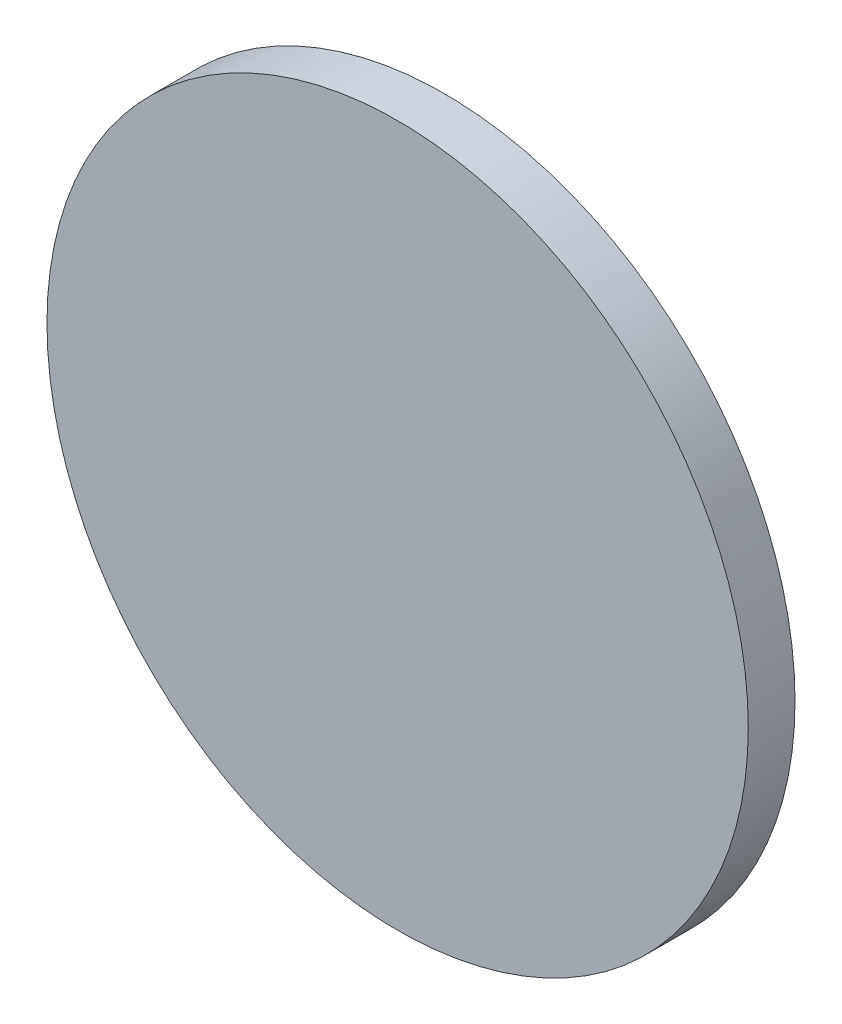
ISO-10303-21;
HEADER;
FILE_DESCRIPTION(('STEP AP214'),'2;1');
FILE_NAME('part.step','',(''),(''),'','','');
FILE_SCHEMA(('AUTOMOTIVE_DESIGN { 1 0 10303 214 1 1 1 1 }'));
ENDSEC;
DATA;
#1=APPLICATION_CONTEXT('core data for automotive mechanical design processes');
#2=APPLICATION_PROTOCOL_DEFINITION('international standard','automotive_design',2000,#1);
#3=PRODUCT_CONTEXT('',#1,'mechanical');
#4=PRODUCT('Part','Part','',(#3));
#5=PRODUCT_RELATED_PRODUCT_CATEGORY('part','',(#4));
#6=PRODUCT_DEFINITION_FORMATION('','',#4);
#7=PRODUCT_DEFINITION_CONTEXT('part definition',#1,'design');
#8=PRODUCT_DEFINITION('design','',#6,#7);
#9=PRODUCT_DEFINITION_SHAPE('','',#8);
#10=(LENGTH_UNIT() NAMED_UNIT(*) SI_UNIT(.MILLI.,.METRE.));
#11=(NAMED_UNIT(*) PLANE_ANGLE_UNIT() SI_UNIT($,.RADIAN.));
#12=(NAMED_UNIT(*) SI_UNIT($,.STERADIAN.) SOLID_ANGLE_UNIT());
#13=UNCERTAINTY_MEASURE_WITH_UNIT(LENGTH_MEASURE(1.E-05),#10,'distance_accuracy_value','');
#14=(GEOMETRIC_REPRESENTATION_CONTEXT(3) GLOBAL_UNCERTAINTY_ASSIGNED_CONTEXT((#13)) GLOBAL_UNIT_ASSIGNED_CONTEXT((#10,
#11,#12)) REPRESENTATION_CONTEXT('',''));
#15=CARTESIAN_POINT('',(0.,0.,0.));
#16=DIRECTION('',(0.,0.,1.));
#17=DIRECTION('',(1.,0.,0.));
#18=AXIS2_PLACEMENT_3D('',#15,#16,#17);
#19=CARTESIAN_POINT('',(475.,-275.,2.));
#20=DIRECTION('',(0.,0.,-1.));
#21=DIRECTION('',(-1.,0.,0.));
#22=AXIS2_PLACEMENT_3D('',#19,#20,#21);
#23=CYLINDRICAL_SURFACE('',#22,15.);
#24=CARTESIAN_POINT('',(475.,-275.,2.));
#25=DIRECTION('',(0.,0.,1.));
#26=DIRECTION('',(1.,0.,0.));
#27=AXIS2_PLACEMENT_3D('',#24,#25,#26);
#28=CIRCLE('',#27,15.);
#29=CARTESIAN_POINT('',(490.,-275.,2.));
#30=VERTEX_POINT('',#29);
#31=EDGE_CURVE('E10',#30,#30,#28,.T.);
#32=ORIENTED_EDGE('',*,*,#31,.F.);
#33=EDGE_LOOP('',(#32));
#34=FACE_BOUND('',#33,.T.);
#35=CARTESIAN_POINT('',(475.,-275.,0.));
#36=DIRECTION('',(0.,0.,1.));
#37=DIRECTION('',(1.,0.,0.));
#38=AXIS2_PLACEMENT_3D('',#35,#36,#37);
#39=CIRCLE('',#38,15.);
#40=CARTESIAN_POINT('',(490.,-275.,0.));
#41=VERTEX_POINT('',#40);
#42=EDGE_CURVE('E32',#41,#41,#39,.T.);
#43=ORIENTED_EDGE('',*,*,#42,.T.);
#44=EDGE_LOOP('',(#43));
#45=FACE_BOUND('',#44,.T.);
#46=ADVANCED_FACE('F29',(#34,#45),#23,.T.);
#47=CARTESIAN_POINT('',(475.,-275.,2.));
#48=DIRECTION('',(0.,0.,1.));
#49=DIRECTION('',(1.,0.,0.));
#50=AXIS2_PLACEMENT_3D('',#47,#48,#49);
#51=PLANE('',#50);
#52=ORIENTED_EDGE('',*,*,#31,.T.);
#53=EDGE_LOOP('',(#52));
#54=FACE_BOUND('',#53,.T.);
#55=ADVANCED_FACE('F44',(#54),#51,.T.);
#56=CARTESIAN_POINT('',(475.,-275.,0.));
#57=DIRECTION('',(0.,0.,1.));
#58=DIRECTION('',(1.,0.,0.));
#59=AXIS2_PLACEMENT_3D('',#56,#57,#58);
#60=PLANE('',#59);
#61=ORIENTED_EDGE('',*,*,#42,.F.);
#62=EDGE_LOOP('',(#61));
#63=FACE_BOUND('',#62,.T.);
#64=ADVANCED_FACE('F42',(#63),#60,.F.);
#65=CLOSED_SHELL('',(#46,#55,#64));
#66=MANIFOLD_SOLID_BREP('B2',#65);
#67=ADVANCED_BREP_SHAPE_REPRESENTATION('',(#18,#66),#14);
#68=SHAPE_DEFINITION_REPRESENTATION(#9,#67);
ENDSEC;
END-ISO-10303-21;
